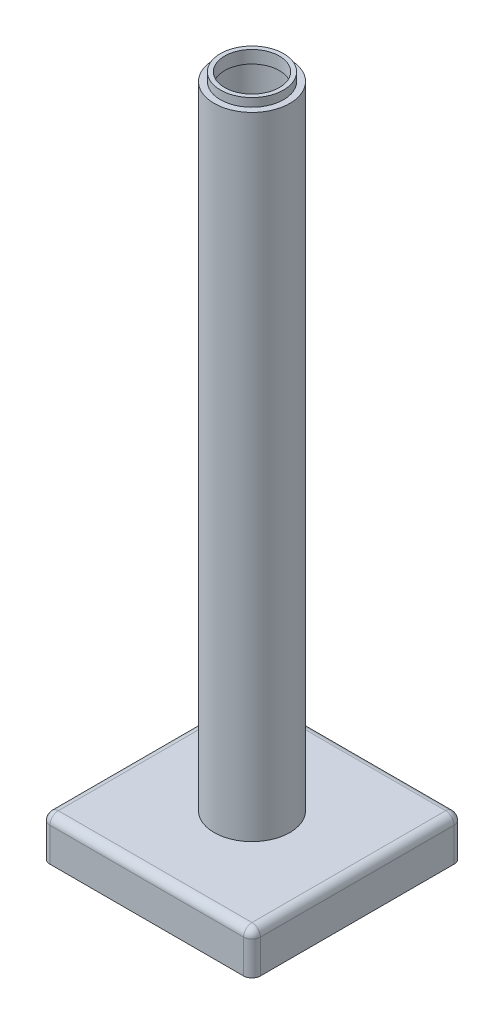
ISO-10303-21;
HEADER;
FILE_DESCRIPTION(('STEP AP214'),'2;1');
FILE_NAME('part.step','',(''),(''),'','','');
FILE_SCHEMA(('AUTOMOTIVE_DESIGN { 1 0 10303 214 1 1 1 1 }'));
ENDSEC;
DATA;
#1=APPLICATION_CONTEXT('core data for automotive mechanical design processes');
#2=APPLICATION_PROTOCOL_DEFINITION('international standard','automotive_design',2000,#1);
#3=PRODUCT_CONTEXT('',#1,'mechanical');
#4=PRODUCT('Part','Part','',(#3));
#5=PRODUCT_RELATED_PRODUCT_CATEGORY('part','',(#4));
#6=PRODUCT_DEFINITION_FORMATION('','',#4);
#7=PRODUCT_DEFINITION_CONTEXT('part definition',#1,'design');
#8=PRODUCT_DEFINITION('design','',#6,#7);
#9=PRODUCT_DEFINITION_SHAPE('','',#8);
#10=(LENGTH_UNIT() NAMED_UNIT(*) SI_UNIT(.MILLI.,.METRE.));
#11=(NAMED_UNIT(*) PLANE_ANGLE_UNIT() SI_UNIT($,.RADIAN.));
#12=(NAMED_UNIT(*) SI_UNIT($,.STERADIAN.) SOLID_ANGLE_UNIT());
#13=UNCERTAINTY_MEASURE_WITH_UNIT(LENGTH_MEASURE(1.E-05),#10,'distance_accuracy_value','');
#14=(GEOMETRIC_REPRESENTATION_CONTEXT(3) GLOBAL_UNCERTAINTY_ASSIGNED_CONTEXT((#13)) GLOBAL_UNIT_ASSIGNED_CONTEXT((#10,
#11,#12)) REPRESENTATION_CONTEXT('',''));
#15=CARTESIAN_POINT('',(0.,0.,0.));
#16=DIRECTION('',(0.,0.,1.));
#17=DIRECTION('',(1.,0.,0.));
#18=AXIS2_PLACEMENT_3D('',#15,#16,#17);
#19=CARTESIAN_POINT('',(0.,160.,0.));
#20=DIRECTION('',(0.,-1.,0.));
#21=DIRECTION('',(0.,0.,-1.));
#22=AXIS2_PLACEMENT_3D('',#19,#20,#21);
#23=CYLINDRICAL_SURFACE('',#22,7.5);
#24=CARTESIAN_POINT('',(0.,10.,0.));
#25=DIRECTION('',(0.,1.,0.));
#26=DIRECTION('',(0.,0.,1.));
#27=AXIS2_PLACEMENT_3D('',#24,#25,#26);
#28=CIRCLE('',#27,7.5);
#29=CARTESIAN_POINT('',(0.,10.,7.5));
#30=VERTEX_POINT('',#29);
#31=EDGE_CURVE('E62',#30,#30,#28,.T.);
#32=ORIENTED_EDGE('',*,*,#31,.F.);
#33=EDGE_LOOP('',(#32));
#34=FACE_BOUND('',#33,.T.);
#35=CARTESIAN_POINT('',(0.,159.,0.));
#36=DIRECTION('',(0.,1.,0.));
#37=DIRECTION('',(0.,0.,1.));
#38=AXIS2_PLACEMENT_3D('',#35,#36,#37);
#39=CIRCLE('',#38,7.5);
#40=CARTESIAN_POINT('',(0.,159.,7.5));
#41=VERTEX_POINT('',#40);
#42=EDGE_CURVE('E68',#41,#41,#39,.T.);
#43=ORIENTED_EDGE('',*,*,#42,.T.);
#44=EDGE_LOOP('',(#43));
#45=FACE_BOUND('',#44,.T.);
#46=ADVANCED_FACE('F49',(#34,#45),#23,.F.);
#47=CARTESIAN_POINT('',(0.,160.,0.));
#48=DIRECTION('',(0.,-1.,0.));
#49=DIRECTION('',(0.,0.,-1.));
#50=AXIS2_PLACEMENT_3D('',#47,#48,#49);
#51=CYLINDRICAL_SURFACE('',#50,9.);
#52=CARTESIAN_POINT('',(0.,160.,0.));
#53=DIRECTION('',(0.,1.,0.));
#54=DIRECTION('',(0.,0.,1.));
#55=AXIS2_PLACEMENT_3D('',#52,#53,#54);
#56=CIRCLE('',#55,9.);
#57=CARTESIAN_POINT('',(0.,160.,9.));
#58=VERTEX_POINT('',#57);
#59=EDGE_CURVE('E11',#58,#58,#56,.T.);
#60=ORIENTED_EDGE('',*,*,#59,.F.);
#61=EDGE_LOOP('',(#60));
#62=FACE_BOUND('',#61,.T.);
#63=CARTESIAN_POINT('',(0.,10.,0.));
#64=DIRECTION('',(0.,1.,0.));
#65=DIRECTION('',(0.,0.,1.));
#66=AXIS2_PLACEMENT_3D('',#63,#64,#65);
#67=CIRCLE('',#66,9.);
#68=CARTESIAN_POINT('',(0.,10.,9.));
#69=VERTEX_POINT('',#68);
#70=EDGE_CURVE('E53',#69,#69,#67,.T.);
#71=ORIENTED_EDGE('',*,*,#70,.T.);
#72=EDGE_LOOP('',(#71));
#73=FACE_BOUND('',#72,.T.);
#74=ADVANCED_FACE('F51',(#62,#73),#51,.T.);
#75=CARTESIAN_POINT('',(0.,160.,0.));
#76=DIRECTION('',(0.,1.,0.));
#77=DIRECTION('',(0.,0.,1.));
#78=AXIS2_PLACEMENT_3D('',#75,#76,#77);
#79=PLANE('',#78);
#80=CARTESIAN_POINT('',(0.,160.,0.));
#81=DIRECTION('',(0.,1.,0.));
#82=DIRECTION('',(0.,0.,1.));
#83=AXIS2_PLACEMENT_3D('',#80,#81,#82);
#84=CIRCLE('',#83,7.5);
#85=CARTESIAN_POINT('',(0.,160.,7.5));
#86=VERTEX_POINT('',#85);
#87=EDGE_CURVE('E60',#86,#86,#84,.T.);
#88=ORIENTED_EDGE('',*,*,#87,.F.);
#89=EDGE_LOOP('',(#88));
#90=FACE_BOUND('',#89,.T.);
#91=ORIENTED_EDGE('',*,*,#59,.T.);
#92=EDGE_LOOP('',(#91));
#93=FACE_BOUND('',#92,.T.);
#94=ADVANCED_FACE('F110',(#90,#93),#79,.T.);
#95=CARTESIAN_POINT('',(0.,10.,0.));
#96=DIRECTION('',(0.,1.,0.));
#97=DIRECTION('',(0.,0.,1.));
#98=AXIS2_PLACEMENT_3D('',#95,#96,#97);
#99=PLANE('',#98);
#100=ORIENTED_EDGE('',*,*,#31,.T.);
#101=EDGE_LOOP('',(#100));
#102=FACE_BOUND('',#101,.T.);
#103=ORIENTED_EDGE('',*,*,#70,.F.);
#104=EDGE_LOOP('',(#103));
#105=FACE_BOUND('',#104,.T.);
#106=ADVANCED_FACE('F102',(#102,#105),#99,.F.);
#107=CARTESIAN_POINT('',(0.,159.,0.));
#108=DIRECTION('',(0.,1.,0.));
#109=DIRECTION('',(0.,0.,1.));
#110=AXIS2_PLACEMENT_3D('',#107,#108,#109);
#111=PLANE('',#110);
#112=CARTESIAN_POINT('',(0.,159.,0.));
#113=DIRECTION('',(0.,1.,0.));
#114=DIRECTION('',(0.,0.,1.));
#115=AXIS2_PLACEMENT_3D('',#112,#113,#114);
#116=CIRCLE('',#115,6.5);
#117=CARTESIAN_POINT('',(0.,159.,6.5));
#118=VERTEX_POINT('',#117);
#119=EDGE_CURVE('E71',#118,#118,#116,.T.);
#120=ORIENTED_EDGE('',*,*,#119,.T.);
#121=EDGE_LOOP('',(#120));
#122=FACE_BOUND('',#121,.T.);
#123=ORIENTED_EDGE('',*,*,#42,.F.);
#124=EDGE_LOOP('',(#123));
#125=FACE_BOUND('',#124,.T.);
#126=ADVANCED_FACE('F80',(#122,#125),#111,.F.);
#127=CARTESIAN_POINT('',(0.,162.,0.));
#128=DIRECTION('',(0.,-1.,0.));
#129=DIRECTION('',(0.,0.,-1.));
#130=AXIS2_PLACEMENT_3D('',#127,#128,#129);
#131=CYLINDRICAL_SURFACE('',#130,7.5);
#132=ORIENTED_EDGE('',*,*,#87,.T.);
#133=EDGE_LOOP('',(#132));
#134=FACE_BOUND('',#133,.T.);
#135=CARTESIAN_POINT('',(0.,162.,0.));
#136=DIRECTION('',(0.,1.,0.));
#137=DIRECTION('',(0.,0.,1.));
#138=AXIS2_PLACEMENT_3D('',#135,#136,#137);
#139=CIRCLE('',#138,7.5);
#140=CARTESIAN_POINT('',(0.,162.,7.5));
#141=VERTEX_POINT('',#140);
#142=EDGE_CURVE('E65',#141,#141,#139,.T.);
#143=ORIENTED_EDGE('',*,*,#142,.F.);
#144=EDGE_LOOP('',(#143));
#145=FACE_BOUND('',#144,.T.);
#146=ADVANCED_FACE('F92',(#134,#145),#131,.T.);
#147=CARTESIAN_POINT('',(0.,162.,0.));
#148=DIRECTION('',(0.,1.,0.));
#149=DIRECTION('',(0.,0.,1.));
#150=AXIS2_PLACEMENT_3D('',#147,#148,#149);
#151=PLANE('',#150);
#152=CARTESIAN_POINT('',(0.,162.,0.));
#153=DIRECTION('',(0.,1.,0.));
#154=DIRECTION('',(0.,0.,1.));
#155=AXIS2_PLACEMENT_3D('',#152,#153,#154);
#156=CIRCLE('',#155,6.5);
#157=CARTESIAN_POINT('',(0.,162.,6.5));
#158=VERTEX_POINT('',#157);
#159=EDGE_CURVE('E74',#158,#158,#156,.T.);
#160=ORIENTED_EDGE('',*,*,#159,.F.);
#161=EDGE_LOOP('',(#160));
#162=FACE_BOUND('',#161,.T.);
#163=ORIENTED_EDGE('',*,*,#142,.T.);
#164=EDGE_LOOP('',(#163));
#165=FACE_BOUND('',#164,.T.);
#166=ADVANCED_FACE('F86',(#162,#165),#151,.T.);
#167=CARTESIAN_POINT('',(0.,162.,0.));
#168=DIRECTION('',(0.,-1.,0.));
#169=DIRECTION('',(0.,0.,-1.));
#170=AXIS2_PLACEMENT_3D('',#167,#168,#169);
#171=CYLINDRICAL_SURFACE('',#170,6.5);
#172=ORIENTED_EDGE('',*,*,#119,.F.);
#173=EDGE_LOOP('',(#172));
#174=FACE_BOUND('',#173,.T.);
#175=ORIENTED_EDGE('',*,*,#159,.T.);
#176=EDGE_LOOP('',(#175));
#177=FACE_BOUND('',#176,.T.);
#178=ADVANCED_FACE('F83',(#174,#177),#171,.F.);
#179=CLOSED_SHELL('',(#46,#74,#94,#106,#126,#146,#166,#178));
#180=MANIFOLD_SOLID_BREP('B2',#179);
#181=CARTESIAN_POINT('',(0.,10.,0.));
#182=DIRECTION('',(0.,-1.,0.));
#183=DIRECTION('',(0.,0.,-1.));
#184=AXIS2_PLACEMENT_3D('',#181,#182,#183);
#185=PLANE('',#184);
#186=DIRECTION('',(-1.,0.,0.));
#187=VECTOR('',#186,1.);
#188=CARTESIAN_POINT('',(0.,10.,-23.));
#189=LINE('',#188,#187);
#190=CARTESIAN_POINT('',(23.,10.,-23.));
#191=VERTEX_POINT('',#190);
#192=CARTESIAN_POINT('',(-23.,10.,-23.));
#193=VERTEX_POINT('',#192);
#194=EDGE_CURVE('E362',#191,#193,#189,.T.);
#195=ORIENTED_EDGE('',*,*,#194,.T.);
#196=DIRECTION('',(0.,0.,1.));
#197=VECTOR('',#196,1.);
#198=CARTESIAN_POINT('',(-23.,10.,0.));
#199=LINE('',#198,#197);
#200=CARTESIAN_POINT('',(-23.,10.,23.));
#201=VERTEX_POINT('',#200);
#202=EDGE_CURVE('E368',#193,#201,#199,.T.);
#203=ORIENTED_EDGE('',*,*,#202,.T.);
#204=DIRECTION('',(1.,0.,0.));
#205=VECTOR('',#204,1.);
#206=CARTESIAN_POINT('',(0.,10.,23.));
#207=LINE('',#206,#205);
#208=CARTESIAN_POINT('',(23.,10.,23.));
#209=VERTEX_POINT('',#208);
#210=EDGE_CURVE('E366',#201,#209,#207,.T.);
#211=ORIENTED_EDGE('',*,*,#210,.T.);
#212=DIRECTION('',(0.,0.,-1.));
#213=VECTOR('',#212,1.);
#214=CARTESIAN_POINT('',(23.,10.,0.));
#215=LINE('',#214,#213);
#216=EDGE_CURVE('E364',#209,#191,#215,.T.);
#217=ORIENTED_EDGE('',*,*,#216,.T.);
#218=EDGE_LOOP('',(#195,#203,#211,#217));
#219=FACE_BOUND('',#218,.T.);
#220=CARTESIAN_POINT('',(0.,10.,0.));
#221=DIRECTION('',(0.,1.,0.));
#222=DIRECTION('',(0.,0.,1.));
#223=AXIS2_PLACEMENT_3D('',#220,#221,#222);
#224=CIRCLE('',#223,7.5);
#225=CARTESIAN_POINT('',(0.,10.,7.5));
#226=VERTEX_POINT('',#225);
#227=EDGE_CURVE('E316',#226,#226,#224,.T.);
#228=ORIENTED_EDGE('',*,*,#227,.F.);
#229=EDGE_LOOP('',(#228));
#230=FACE_BOUND('',#229,.T.);
#231=ADVANCED_FACE('F187',(#219,#230),#185,.F.);
#232=CARTESIAN_POINT('',(0.,0.,0.));
#233=DIRECTION('',(0.,-1.,0.));
#234=DIRECTION('',(0.,0.,-1.));
#235=AXIS2_PLACEMENT_3D('',#232,#233,#234);
#236=PLANE('',#235);
#237=DIRECTION('',(0.,0.,-1.));
#238=VECTOR('',#237,1.);
#239=CARTESIAN_POINT('',(-4.,0.,-5.15547727241241));
#240=LINE('',#239,#238);
#241=CARTESIAN_POINT('',(-4.,0.,-6.34428877022476));
#242=VERTEX_POINT('',#241);
#243=CARTESIAN_POINT('',(-4.,0.,-25.));
#244=VERTEX_POINT('',#243);
#245=EDGE_CURVE('E302',#242,#244,#240,.T.);
#246=ORIENTED_EDGE('',*,*,#245,.F.);
#247=CARTESIAN_POINT('',(0.,0.,0.));
#248=DIRECTION('',(0.,1.,0.));
#249=DIRECTION('',(0.,0.,1.));
#250=AXIS2_PLACEMENT_3D('',#247,#248,#249);
#251=CIRCLE('',#250,7.5);
#252=CARTESIAN_POINT('',(4.,0.,-6.34428877022476));
#253=VERTEX_POINT('',#252);
#254=EDGE_CURVE('E320',#242,#253,#251,.T.);
#255=ORIENTED_EDGE('',*,*,#254,.T.);
#256=DIRECTION('',(0.,0.,1.));
#257=VECTOR('',#256,1.);
#258=CARTESIAN_POINT('',(4.,0.,-5.15547727241241));
#259=LINE('',#258,#257);
#260=CARTESIAN_POINT('',(4.,0.,-25.));
#261=VERTEX_POINT('',#260);
#262=EDGE_CURVE('E296',#261,#253,#259,.T.);
#263=ORIENTED_EDGE('',*,*,#262,.F.);
#264=DIRECTION('',(-1.,0.,0.));
#265=VECTOR('',#264,1.);
#266=CARTESIAN_POINT('',(-25.,0.,-25.));
#267=LINE('',#266,#265);
#268=CARTESIAN_POINT('',(23.,0.,-25.));
#269=VERTEX_POINT('',#268);
#270=EDGE_CURVE('E326',#269,#261,#267,.T.);
#271=ORIENTED_EDGE('',*,*,#270,.F.);
#272=CARTESIAN_POINT('',(23.,0.,-23.));
#273=DIRECTION('',(0.,-1.,0.));
#274=DIRECTION('',(0.,0.,-1.));
#275=AXIS2_PLACEMENT_3D('',#272,#273,#274);
#276=CIRCLE('',#275,2.);
#277=CARTESIAN_POINT('',(25.,0.,-23.));
#278=VERTEX_POINT('',#277);
#279=EDGE_CURVE('E343',#269,#278,#276,.T.);
#280=ORIENTED_EDGE('',*,*,#279,.T.);
#281=DIRECTION('',(0.,0.,-1.));
#282=VECTOR('',#281,1.);
#283=CARTESIAN_POINT('',(25.,0.,25.));
#284=LINE('',#283,#282);
#285=CARTESIAN_POINT('',(25.,0.,23.));
#286=VERTEX_POINT('',#285);
#287=EDGE_CURVE('E319',#286,#278,#284,.T.);
#288=ORIENTED_EDGE('',*,*,#287,.F.);
#289=CARTESIAN_POINT('',(23.,0.,23.));
#290=DIRECTION('',(0.,-1.,0.));
#291=DIRECTION('',(0.,0.,-1.));
#292=AXIS2_PLACEMENT_3D('',#289,#290,#291);
#293=CIRCLE('',#292,2.);
#294=CARTESIAN_POINT('',(23.,0.,25.));
#295=VERTEX_POINT('',#294);
#296=EDGE_CURVE('E341',#286,#295,#293,.T.);
#297=ORIENTED_EDGE('',*,*,#296,.T.);
#298=DIRECTION('',(1.,0.,0.));
#299=VECTOR('',#298,1.);
#300=CARTESIAN_POINT('',(-25.,0.,25.));
#301=LINE('',#300,#299);
#302=CARTESIAN_POINT('',(-23.,0.,25.));
#303=VERTEX_POINT('',#302);
#304=EDGE_CURVE('E331',#303,#295,#301,.T.);
#305=ORIENTED_EDGE('',*,*,#304,.F.);
#306=CARTESIAN_POINT('',(-23.,0.,23.));
#307=DIRECTION('',(0.,-1.,0.));
#308=DIRECTION('',(0.,0.,-1.));
#309=AXIS2_PLACEMENT_3D('',#306,#307,#308);
#310=CIRCLE('',#309,2.);
#311=CARTESIAN_POINT('',(-25.,0.,23.));
#312=VERTEX_POINT('',#311);
#313=EDGE_CURVE('E348',#303,#312,#310,.T.);
#314=ORIENTED_EDGE('',*,*,#313,.T.);
#315=DIRECTION('',(0.,0.,1.));
#316=VECTOR('',#315,1.);
#317=CARTESIAN_POINT('',(-25.,0.,25.));
#318=LINE('',#317,#316);
#319=CARTESIAN_POINT('',(-25.,0.,-23.));
#320=VERTEX_POINT('',#319);
#321=EDGE_CURVE('E328',#320,#312,#318,.T.);
#322=ORIENTED_EDGE('',*,*,#321,.F.);
#323=CARTESIAN_POINT('',(-23.,0.,-23.));
#324=DIRECTION('',(0.,-1.,0.));
#325=DIRECTION('',(0.,0.,-1.));
#326=AXIS2_PLACEMENT_3D('',#323,#324,#325);
#327=CIRCLE('',#326,2.);
#328=CARTESIAN_POINT('',(-23.,0.,-25.));
#329=VERTEX_POINT('',#328);
#330=EDGE_CURVE('E345',#320,#329,#327,.T.);
#331=ORIENTED_EDGE('',*,*,#330,.T.);
#332=EDGE_CURVE('E325',#244,#329,#267,.T.);
#333=ORIENTED_EDGE('',*,*,#332,.F.);
#334=EDGE_LOOP('',(#246,#255,#263,#271,#280,#288,#297,#305,#314,#322,#331,#333));
#335=FACE_BOUND('',#334,.T.);
#336=ADVANCED_FACE('F418',(#335),#236,.T.);
#337=CARTESIAN_POINT('',(25.,10.,25.));
#338=DIRECTION('',(-1.,0.,0.));
#339=DIRECTION('',(0.,0.,1.));
#340=AXIS2_PLACEMENT_3D('',#337,#338,#339);
#341=PLANE('',#340);
#342=ORIENTED_EDGE('',*,*,#287,.T.);
#343=DIRECTION('',(0.,-1.,0.));
#344=VECTOR('',#343,1.);
#345=CARTESIAN_POINT('',(25.,10.,-23.));
#346=LINE('',#345,#344);
#347=CARTESIAN_POINT('',(25.,8.,-23.));
#348=VERTEX_POINT('',#347);
#349=EDGE_CURVE('E210',#278,#348,#346,.F.);
#350=ORIENTED_EDGE('',*,*,#349,.T.);
#351=DIRECTION('',(0.,0.,-1.));
#352=VECTOR('',#351,1.);
#353=CARTESIAN_POINT('',(25.,8.,25.));
#354=LINE('',#353,#352);
#355=CARTESIAN_POINT('',(25.,8.,23.));
#356=VERTEX_POINT('',#355);
#357=EDGE_CURVE('E373',#348,#356,#354,.F.);
#358=ORIENTED_EDGE('',*,*,#357,.T.);
#359=DIRECTION('',(0.,-1.,0.));
#360=VECTOR('',#359,1.);
#361=CARTESIAN_POINT('',(25.,10.,23.));
#362=LINE('',#361,#360);
#363=EDGE_CURVE('E371',#356,#286,#362,.T.);
#364=ORIENTED_EDGE('',*,*,#363,.T.);
#365=EDGE_LOOP('',(#342,#350,#358,#364));
#366=FACE_BOUND('',#365,.T.);
#367=ADVANCED_FACE('F457',(#366),#341,.F.);
#368=CARTESIAN_POINT('',(-25.,10.,-25.));
#369=DIRECTION('',(0.,0.,1.));
#370=DIRECTION('',(1.,0.,0.));
#371=AXIS2_PLACEMENT_3D('',#368,#369,#370);
#372=PLANE('',#371);
#373=DIRECTION('',(1.,0.,0.));
#374=VECTOR('',#373,1.);
#375=CARTESIAN_POINT('',(4.,7.,-25.));
#376=LINE('',#375,#374);
#377=CARTESIAN_POINT('',(-4.,7.,-25.));
#378=VERTEX_POINT('',#377);
#379=CARTESIAN_POINT('',(4.,7.,-25.));
#380=VERTEX_POINT('',#379);
#381=EDGE_CURVE('E290',#378,#380,#376,.T.);
#382=ORIENTED_EDGE('',*,*,#381,.F.);
#383=DIRECTION('',(0.,-1.,0.));
#384=VECTOR('',#383,1.);
#385=CARTESIAN_POINT('',(-4.,7.,-25.));
#386=LINE('',#385,#384);
#387=EDGE_CURVE('E299',#378,#244,#386,.T.);
#388=ORIENTED_EDGE('',*,*,#387,.T.);
#389=ORIENTED_EDGE('',*,*,#332,.T.);
#390=DIRECTION('',(0.,-1.,0.));
#391=VECTOR('',#390,1.);
#392=CARTESIAN_POINT('',(-23.,10.,-25.));
#393=LINE('',#392,#391);
#394=CARTESIAN_POINT('',(-23.,8.,-25.));
#395=VERTEX_POINT('',#394);
#396=EDGE_CURVE('E360',#329,#395,#393,.F.);
#397=ORIENTED_EDGE('',*,*,#396,.T.);
#398=DIRECTION('',(-1.,0.,0.));
#399=VECTOR('',#398,1.);
#400=CARTESIAN_POINT('',(-25.,8.,-25.));
#401=LINE('',#400,#399);
#402=CARTESIAN_POINT('',(23.,8.,-25.));
#403=VERTEX_POINT('',#402);
#404=EDGE_CURVE('E358',#395,#403,#401,.F.);
#405=ORIENTED_EDGE('',*,*,#404,.T.);
#406=DIRECTION('',(0.,-1.,0.));
#407=VECTOR('',#406,1.);
#408=CARTESIAN_POINT('',(23.,10.,-25.));
#409=LINE('',#408,#407);
#410=EDGE_CURVE('E356',#403,#269,#409,.T.);
#411=ORIENTED_EDGE('',*,*,#410,.T.);
#412=ORIENTED_EDGE('',*,*,#270,.T.);
#413=DIRECTION('',(0.,-1.,0.));
#414=VECTOR('',#413,1.);
#415=CARTESIAN_POINT('',(4.,7.,-25.));
#416=LINE('',#415,#414);
#417=EDGE_CURVE('E305',#380,#261,#416,.T.);
#418=ORIENTED_EDGE('',*,*,#417,.F.);
#419=EDGE_LOOP('',(#382,#388,#389,#397,#405,#411,#412,#418));
#420=FACE_BOUND('',#419,.T.);
#421=ADVANCED_FACE('F307',(#420),#372,.F.);
#422=CARTESIAN_POINT('',(-25.,10.,25.));
#423=DIRECTION('',(1.,0.,0.));
#424=DIRECTION('',(0.,0.,-1.));
#425=AXIS2_PLACEMENT_3D('',#422,#423,#424);
#426=PLANE('',#425);
#427=ORIENTED_EDGE('',*,*,#321,.T.);
#428=DIRECTION('',(0.,-1.,0.));
#429=VECTOR('',#428,1.);
#430=CARTESIAN_POINT('',(-25.,10.,23.));
#431=LINE('',#430,#429);
#432=CARTESIAN_POINT('',(-25.,8.,23.));
#433=VERTEX_POINT('',#432);
#434=EDGE_CURVE('E354',#312,#433,#431,.F.);
#435=ORIENTED_EDGE('',*,*,#434,.T.);
#436=DIRECTION('',(0.,0.,1.));
#437=VECTOR('',#436,1.);
#438=CARTESIAN_POINT('',(-25.,8.,25.));
#439=LINE('',#438,#437);
#440=CARTESIAN_POINT('',(-25.,8.,-23.));
#441=VERTEX_POINT('',#440);
#442=EDGE_CURVE('E350',#433,#441,#439,.F.);
#443=ORIENTED_EDGE('',*,*,#442,.T.);
#444=DIRECTION('',(0.,-1.,0.));
#445=VECTOR('',#444,1.);
#446=CARTESIAN_POINT('',(-25.,10.,-23.));
#447=LINE('',#446,#445);
#448=EDGE_CURVE('E352',#441,#320,#447,.T.);
#449=ORIENTED_EDGE('',*,*,#448,.T.);
#450=EDGE_LOOP('',(#427,#435,#443,#449));
#451=FACE_BOUND('',#450,.T.);
#452=ADVANCED_FACE('F478',(#451),#426,.F.);
#453=CARTESIAN_POINT('',(-25.,10.,25.));
#454=DIRECTION('',(0.,0.,-1.));
#455=DIRECTION('',(-1.,0.,0.));
#456=AXIS2_PLACEMENT_3D('',#453,#454,#455);
#457=PLANE('',#456);
#458=DIRECTION('',(1.,0.,0.));
#459=VECTOR('',#458,1.);
#460=CARTESIAN_POINT('',(-25.,8.,25.));
#461=LINE('',#460,#459);
#462=CARTESIAN_POINT('',(23.,8.,25.));
#463=VERTEX_POINT('',#462);
#464=CARTESIAN_POINT('',(-23.,8.,25.));
#465=VERTEX_POINT('',#464);
#466=EDGE_CURVE('E336',#463,#465,#461,.F.);
#467=ORIENTED_EDGE('',*,*,#466,.T.);
#468=DIRECTION('',(0.,-1.,0.));
#469=VECTOR('',#468,1.);
#470=CARTESIAN_POINT('',(-23.,10.,25.));
#471=LINE('',#470,#469);
#472=EDGE_CURVE('E338',#465,#303,#471,.T.);
#473=ORIENTED_EDGE('',*,*,#472,.T.);
#474=ORIENTED_EDGE('',*,*,#304,.T.);
#475=DIRECTION('',(0.,-1.,0.));
#476=VECTOR('',#475,1.);
#477=CARTESIAN_POINT('',(23.,10.,25.));
#478=LINE('',#477,#476);
#479=EDGE_CURVE('E334',#295,#463,#478,.F.);
#480=ORIENTED_EDGE('',*,*,#479,.T.);
#481=EDGE_LOOP('',(#467,#473,#474,#480));
#482=FACE_BOUND('',#481,.T.);
#483=ADVANCED_FACE('F472',(#482),#457,.F.);
#484=CARTESIAN_POINT('',(0.,10.,0.));
#485=DIRECTION('',(0.,-1.,0.));
#486=DIRECTION('',(0.,0.,-1.));
#487=AXIS2_PLACEMENT_3D('',#484,#485,#486);
#488=CYLINDRICAL_SURFACE('',#487,7.5);
#489=DIRECTION('',(0.,-1.,0.));
#490=VECTOR('',#489,1.);
#491=CARTESIAN_POINT('',(-4.,10.,-6.34428877022476));
#492=LINE('',#491,#490);
#493=CARTESIAN_POINT('',(-4.,7.,-6.34428877022476));
#494=VERTEX_POINT('',#493);
#495=EDGE_CURVE('E47',#494,#242,#492,.T.);
#496=ORIENTED_EDGE('',*,*,#495,.F.);
#497=CARTESIAN_POINT('',(0.,7.,0.));
#498=DIRECTION('',(0.,1.,0.));
#499=DIRECTION('',(0.,0.,1.));
#500=AXIS2_PLACEMENT_3D('',#497,#498,#499);
#501=CIRCLE('',#500,7.5);
#502=CARTESIAN_POINT('',(4.,7.,-6.34428877022476));
#503=VERTEX_POINT('',#502);
#504=EDGE_CURVE('E293',#503,#494,#501,.T.);
#505=ORIENTED_EDGE('',*,*,#504,.F.);
#506=DIRECTION('',(0.,-1.,0.));
#507=VECTOR('',#506,1.);
#508=CARTESIAN_POINT('',(4.,10.,-6.34428877022476));
#509=LINE('',#508,#507);
#510=EDGE_CURVE('E195',#253,#503,#509,.F.);
#511=ORIENTED_EDGE('',*,*,#510,.F.);
#512=ORIENTED_EDGE('',*,*,#254,.F.);
#513=EDGE_LOOP('',(#496,#505,#511,#512));
#514=FACE_BOUND('',#513,.T.);
#515=ORIENTED_EDGE('',*,*,#227,.T.);
#516=EDGE_LOOP('',(#515));
#517=FACE_BOUND('',#516,.T.);
#518=ADVANCED_FACE('F415',(#514,#517),#488,.F.);
#519=CARTESIAN_POINT('',(23.,10.,-23.));
#520=DIRECTION('',(0.,-1.,0.));
#521=DIRECTION('',(0.,0.,-1.));
#522=AXIS2_PLACEMENT_3D('',#519,#520,#521);
#523=CYLINDRICAL_SURFACE('',#522,2.);
#524=CARTESIAN_POINT('',(23.,8.,-23.));
#525=DIRECTION('',(0.,1.,0.));
#526=DIRECTION('',(0.,0.,1.));
#527=AXIS2_PLACEMENT_3D('',#524,#525,#526);
#528=CIRCLE('',#527,2.);
#529=EDGE_CURVE('E323',#348,#403,#528,.T.);
#530=ORIENTED_EDGE('',*,*,#529,.F.);
#531=ORIENTED_EDGE('',*,*,#349,.F.);
#532=ORIENTED_EDGE('',*,*,#279,.F.);
#533=ORIENTED_EDGE('',*,*,#410,.F.);
#534=EDGE_LOOP('',(#530,#531,#532,#533));
#535=FACE_BOUND('',#534,.T.);
#536=ADVANCED_FACE('F189',(#535),#523,.T.);
#537=CARTESIAN_POINT('',(23.,8.,-23.));
#538=DIRECTION('',(0.,0.,-1.));
#539=DIRECTION('',(-1.,0.,0.));
#540=AXIS2_PLACEMENT_3D('',#537,#538,#539);
#541=SPHERICAL_SURFACE('',#540,2.);
#542=CARTESIAN_POINT('',(23.,8.,-23.));
#543=DIRECTION('',(0.,0.,-1.));
#544=DIRECTION('',(-1.,0.,0.));
#545=AXIS2_PLACEMENT_3D('',#542,#543,#544);
#546=CIRCLE('',#545,2.);
#547=EDGE_CURVE('E401',#348,#191,#546,.F.);
#548=ORIENTED_EDGE('',*,*,#547,.F.);
#549=ORIENTED_EDGE('',*,*,#529,.T.);
#550=CARTESIAN_POINT('',(23.,8.,-23.));
#551=DIRECTION('',(1.,0.,0.));
#552=DIRECTION('',(0.,1.,0.));
#553=AXIS2_PLACEMENT_3D('',#550,#551,#552);
#554=CIRCLE('',#553,2.);
#555=EDGE_CURVE('E404',#191,#403,#554,.F.);
#556=ORIENTED_EDGE('',*,*,#555,.F.);
#557=EDGE_LOOP('',(#548,#549,#556));
#558=FACE_BOUND('',#557,.T.);
#559=ADVANCED_FACE('F451',(#558),#541,.T.);
#560=CARTESIAN_POINT('',(-23.,10.,-23.));
#561=DIRECTION('',(0.,-1.,0.));
#562=DIRECTION('',(0.,0.,-1.));
#563=AXIS2_PLACEMENT_3D('',#560,#561,#562);
#564=CYLINDRICAL_SURFACE('',#563,2.);
#565=ORIENTED_EDGE('',*,*,#330,.F.);
#566=ORIENTED_EDGE('',*,*,#448,.F.);
#567=CARTESIAN_POINT('',(-23.,8.,-23.));
#568=DIRECTION('',(0.,1.,0.));
#569=DIRECTION('',(0.,0.,1.));
#570=AXIS2_PLACEMENT_3D('',#567,#568,#569);
#571=CIRCLE('',#570,2.);
#572=EDGE_CURVE('E398',#395,#441,#571,.T.);
#573=ORIENTED_EDGE('',*,*,#572,.F.);
#574=ORIENTED_EDGE('',*,*,#396,.F.);
#575=EDGE_LOOP('',(#565,#566,#573,#574));
#576=FACE_BOUND('',#575,.T.);
#577=ADVANCED_FACE('F433',(#576),#564,.T.);
#578=CARTESIAN_POINT('',(0.,8.,-23.));
#579=DIRECTION('',(-1.,0.,0.));
#580=DIRECTION('',(0.,0.,1.));
#581=AXIS2_PLACEMENT_3D('',#578,#579,#580);
#582=CYLINDRICAL_SURFACE('',#581,2.);
#583=ORIENTED_EDGE('',*,*,#555,.T.);
#584=ORIENTED_EDGE('',*,*,#404,.F.);
#585=CARTESIAN_POINT('',(-23.,8.,-23.));
#586=DIRECTION('',(-1.,0.,0.));
#587=DIRECTION('',(0.,0.,1.));
#588=AXIS2_PLACEMENT_3D('',#585,#586,#587);
#589=CIRCLE('',#588,2.);
#590=EDGE_CURVE('E395',#193,#395,#589,.T.);
#591=ORIENTED_EDGE('',*,*,#590,.F.);
#592=ORIENTED_EDGE('',*,*,#194,.F.);
#593=EDGE_LOOP('',(#583,#584,#591,#592));
#594=FACE_BOUND('',#593,.T.);
#595=ADVANCED_FACE('F428',(#594),#582,.T.);
#596=CARTESIAN_POINT('',(23.,8.,0.));
#597=DIRECTION('',(0.,0.,-1.));
#598=DIRECTION('',(-1.,0.,0.));
#599=AXIS2_PLACEMENT_3D('',#596,#597,#598);
#600=CYLINDRICAL_SURFACE('',#599,2.);
#601=ORIENTED_EDGE('',*,*,#547,.T.);
#602=ORIENTED_EDGE('',*,*,#216,.F.);
#603=CARTESIAN_POINT('',(23.,8.,23.));
#604=DIRECTION('',(0.,0.,1.));
#605=DIRECTION('',(1.,0.,0.));
#606=AXIS2_PLACEMENT_3D('',#603,#604,#605);
#607=CIRCLE('',#606,2.);
#608=EDGE_CURVE('E392',#356,#209,#607,.T.);
#609=ORIENTED_EDGE('',*,*,#608,.F.);
#610=ORIENTED_EDGE('',*,*,#357,.F.);
#611=EDGE_LOOP('',(#601,#602,#609,#610));
#612=FACE_BOUND('',#611,.T.);
#613=ADVANCED_FACE('F449',(#612),#600,.T.);
#614=CARTESIAN_POINT('',(23.,10.,23.));
#615=DIRECTION('',(0.,-1.,0.));
#616=DIRECTION('',(0.,0.,-1.));
#617=AXIS2_PLACEMENT_3D('',#614,#615,#616);
#618=CYLINDRICAL_SURFACE('',#617,2.);
#619=ORIENTED_EDGE('',*,*,#296,.F.);
#620=ORIENTED_EDGE('',*,*,#363,.F.);
#621=CARTESIAN_POINT('',(23.,8.,23.));
#622=DIRECTION('',(0.,1.,0.));
#623=DIRECTION('',(0.,0.,1.));
#624=AXIS2_PLACEMENT_3D('',#621,#622,#623);
#625=CIRCLE('',#624,2.);
#626=EDGE_CURVE('E389',#463,#356,#625,.T.);
#627=ORIENTED_EDGE('',*,*,#626,.F.);
#628=ORIENTED_EDGE('',*,*,#479,.F.);
#629=EDGE_LOOP('',(#619,#620,#627,#628));
#630=FACE_BOUND('',#629,.T.);
#631=ADVANCED_FACE('F461',(#630),#618,.T.);
#632=CARTESIAN_POINT('',(-23.,8.,-23.));
#633=DIRECTION('',(0.,0.,-1.));
#634=DIRECTION('',(-1.,0.,0.));
#635=AXIS2_PLACEMENT_3D('',#632,#633,#634);
#636=SPHERICAL_SURFACE('',#635,2.);
#637=ORIENTED_EDGE('',*,*,#590,.T.);
#638=ORIENTED_EDGE('',*,*,#572,.T.);
#639=CARTESIAN_POINT('',(-23.,8.,-23.));
#640=DIRECTION('',(0.,0.,-1.));
#641=DIRECTION('',(-1.,0.,0.));
#642=AXIS2_PLACEMENT_3D('',#639,#640,#641);
#643=CIRCLE('',#642,2.);
#644=EDGE_CURVE('E386',#193,#441,#643,.F.);
#645=ORIENTED_EDGE('',*,*,#644,.F.);
#646=EDGE_LOOP('',(#637,#638,#645));
#647=FACE_BOUND('',#646,.T.);
#648=ADVANCED_FACE('F435',(#647),#636,.T.);
#649=CARTESIAN_POINT('',(23.,8.,23.));
#650=DIRECTION('',(1.,0.,0.));
#651=DIRECTION('',(0.,0.,-1.));
#652=AXIS2_PLACEMENT_3D('',#649,#650,#651);
#653=SPHERICAL_SURFACE('',#652,2.);
#654=ORIENTED_EDGE('',*,*,#626,.T.);
#655=ORIENTED_EDGE('',*,*,#608,.T.);
#656=CARTESIAN_POINT('',(23.,8.,23.));
#657=DIRECTION('',(1.,0.,0.));
#658=DIRECTION('',(0.,0.,-1.));
#659=AXIS2_PLACEMENT_3D('',#656,#657,#658);
#660=CIRCLE('',#659,2.);
#661=EDGE_CURVE('E383',#463,#209,#660,.F.);
#662=ORIENTED_EDGE('',*,*,#661,.F.);
#663=EDGE_LOOP('',(#654,#655,#662));
#664=FACE_BOUND('',#663,.T.);
#665=ADVANCED_FACE('F465',(#664),#653,.T.);
#666=CARTESIAN_POINT('',(-23.,8.,0.));
#667=DIRECTION('',(0.,0.,1.));
#668=DIRECTION('',(1.,0.,0.));
#669=AXIS2_PLACEMENT_3D('',#666,#667,#668);
#670=CYLINDRICAL_SURFACE('',#669,2.);
#671=ORIENTED_EDGE('',*,*,#644,.T.);
#672=ORIENTED_EDGE('',*,*,#442,.F.);
#673=CARTESIAN_POINT('',(-23.,8.,23.));
#674=DIRECTION('',(0.,0.,1.));
#675=DIRECTION('',(1.,0.,0.));
#676=AXIS2_PLACEMENT_3D('',#673,#674,#675);
#677=CIRCLE('',#676,2.);
#678=EDGE_CURVE('E380',#201,#433,#677,.T.);
#679=ORIENTED_EDGE('',*,*,#678,.F.);
#680=ORIENTED_EDGE('',*,*,#202,.F.);
#681=EDGE_LOOP('',(#671,#672,#679,#680));
#682=FACE_BOUND('',#681,.T.);
#683=ADVANCED_FACE('F440',(#682),#670,.T.);
#684=CARTESIAN_POINT('',(0.,8.,23.));
#685=DIRECTION('',(1.,0.,0.));
#686=DIRECTION('',(0.,0.,-1.));
#687=AXIS2_PLACEMENT_3D('',#684,#685,#686);
#688=CYLINDRICAL_SURFACE('',#687,2.);
#689=ORIENTED_EDGE('',*,*,#661,.T.);
#690=ORIENTED_EDGE('',*,*,#210,.F.);
#691=CARTESIAN_POINT('',(-23.,8.,23.));
#692=DIRECTION('',(-1.,0.,0.));
#693=DIRECTION('',(0.,0.,1.));
#694=AXIS2_PLACEMENT_3D('',#691,#692,#693);
#695=CIRCLE('',#694,2.);
#696=EDGE_CURVE('E378',#465,#201,#695,.T.);
#697=ORIENTED_EDGE('',*,*,#696,.F.);
#698=ORIENTED_EDGE('',*,*,#466,.F.);
#699=EDGE_LOOP('',(#689,#690,#697,#698));
#700=FACE_BOUND('',#699,.T.);
#701=ADVANCED_FACE('F469',(#700),#688,.T.);
#702=CARTESIAN_POINT('',(-23.,8.,23.));
#703=DIRECTION('',(0.,1.,0.));
#704=DIRECTION('',(0.,0.,1.));
#705=AXIS2_PLACEMENT_3D('',#702,#703,#704);
#706=SPHERICAL_SURFACE('',#705,2.);
#707=ORIENTED_EDGE('',*,*,#696,.T.);
#708=ORIENTED_EDGE('',*,*,#678,.T.);
#709=CARTESIAN_POINT('',(-23.,8.,23.));
#710=DIRECTION('',(0.,1.,0.));
#711=DIRECTION('',(0.,0.,1.));
#712=AXIS2_PLACEMENT_3D('',#709,#710,#711);
#713=CIRCLE('',#712,2.);
#714=EDGE_CURVE('E314',#465,#433,#713,.F.);
#715=ORIENTED_EDGE('',*,*,#714,.F.);
#716=EDGE_LOOP('',(#707,#708,#715));
#717=FACE_BOUND('',#716,.T.);
#718=ADVANCED_FACE('F481',(#717),#706,.T.);
#719=CARTESIAN_POINT('',(-23.,10.,23.));
#720=DIRECTION('',(0.,-1.,0.));
#721=DIRECTION('',(0.,0.,-1.));
#722=AXIS2_PLACEMENT_3D('',#719,#720,#721);
#723=CYLINDRICAL_SURFACE('',#722,2.);
#724=ORIENTED_EDGE('',*,*,#714,.T.);
#725=ORIENTED_EDGE('',*,*,#434,.F.);
#726=ORIENTED_EDGE('',*,*,#313,.F.);
#727=ORIENTED_EDGE('',*,*,#472,.F.);
#728=EDGE_LOOP('',(#724,#725,#726,#727));
#729=FACE_BOUND('',#728,.T.);
#730=ADVANCED_FACE('F479',(#729),#723,.T.);
#731=CARTESIAN_POINT('',(-4.,7.,-5.15547727241241));
#732=DIRECTION('',(-1.,0.,0.));
#733=DIRECTION('',(0.,0.,1.));
#734=AXIS2_PLACEMENT_3D('',#731,#732,#733);
#735=PLANE('',#734);
#736=ORIENTED_EDGE('',*,*,#495,.T.);
#737=ORIENTED_EDGE('',*,*,#245,.T.);
#738=ORIENTED_EDGE('',*,*,#387,.F.);
#739=DIRECTION('',(0.,0.,-1.));
#740=VECTOR('',#739,1.);
#741=CARTESIAN_POINT('',(-4.,7.,-5.15547727241241));
#742=LINE('',#741,#740);
#743=EDGE_CURVE('E286',#494,#378,#742,.T.);
#744=ORIENTED_EDGE('',*,*,#743,.F.);
#745=EDGE_LOOP('',(#736,#737,#738,#744));
#746=FACE_BOUND('',#745,.T.);
#747=ADVANCED_FACE('F300',(#746),#735,.F.);
#748=CARTESIAN_POINT('',(4.,7.,-5.15547727241241));
#749=DIRECTION('',(1.,0.,0.));
#750=DIRECTION('',(0.,0.,-1.));
#751=AXIS2_PLACEMENT_3D('',#748,#749,#750);
#752=PLANE('',#751);
#753=ORIENTED_EDGE('',*,*,#510,.T.);
#754=DIRECTION('',(0.,0.,1.));
#755=VECTOR('',#754,1.);
#756=CARTESIAN_POINT('',(4.,7.,-5.15547727241241));
#757=LINE('',#756,#755);
#758=EDGE_CURVE('E202',#380,#503,#757,.T.);
#759=ORIENTED_EDGE('',*,*,#758,.F.);
#760=ORIENTED_EDGE('',*,*,#417,.T.);
#761=ORIENTED_EDGE('',*,*,#262,.T.);
#762=EDGE_LOOP('',(#753,#759,#760,#761));
#763=FACE_BOUND('',#762,.T.);
#764=ADVANCED_FACE('F411',(#763),#752,.F.);
#765=CARTESIAN_POINT('',(0.,7.,0.));
#766=DIRECTION('',(0.,1.,0.));
#767=DIRECTION('',(0.,0.,1.));
#768=AXIS2_PLACEMENT_3D('',#765,#766,#767);
#769=PLANE('',#768);
#770=ORIENTED_EDGE('',*,*,#504,.T.);
#771=ORIENTED_EDGE('',*,*,#743,.T.);
#772=ORIENTED_EDGE('',*,*,#381,.T.);
#773=ORIENTED_EDGE('',*,*,#758,.T.);
#774=EDGE_LOOP('',(#770,#771,#772,#773));
#775=FACE_BOUND('',#774,.T.);
#776=ADVANCED_FACE('F288',(#775),#769,.F.);
#777=CLOSED_SHELL('',(#231,#336,#367,#421,#452,#483,#518,#536,#559,#577,#595,#613,#631,#648,
#665,#683,#701,#718,#730,#747,#764,#776));
#778=MANIFOLD_SOLID_BREP('B6',#777);
#779=ADVANCED_BREP_SHAPE_REPRESENTATION('',(#18,#180,#778),#14);
#780=SHAPE_DEFINITION_REPRESENTATION(#9,#779);
ENDSEC;
END-ISO-10303-21;
